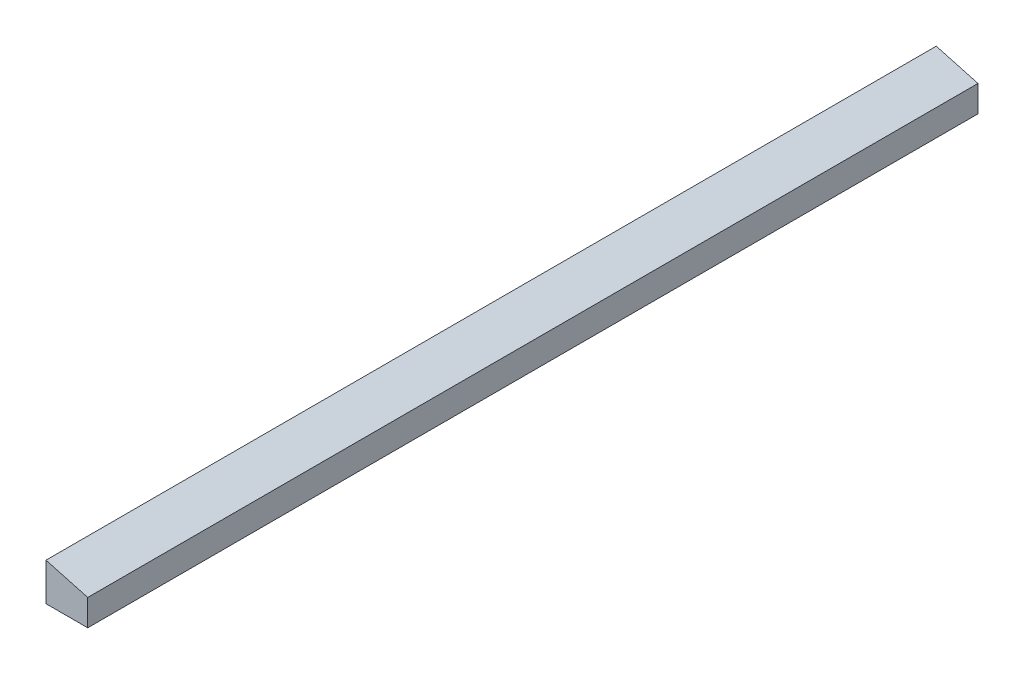
ISO-10303-21;
HEADER;
FILE_DESCRIPTION(('STEP AP214'),'2;1');
FILE_NAME('part.step','',(''),(''),'','','');
FILE_SCHEMA(('AUTOMOTIVE_DESIGN { 1 0 10303 214 1 1 1 1 }'));
ENDSEC;
DATA;
#1=APPLICATION_CONTEXT('core data for automotive mechanical design processes');
#2=APPLICATION_PROTOCOL_DEFINITION('international standard','automotive_design',2000,#1);
#3=PRODUCT_CONTEXT('',#1,'mechanical');
#4=PRODUCT('Part','Part','',(#3));
#5=PRODUCT_RELATED_PRODUCT_CATEGORY('part','',(#4));
#6=PRODUCT_DEFINITION_FORMATION('','',#4);
#7=PRODUCT_DEFINITION_CONTEXT('part definition',#1,'design');
#8=PRODUCT_DEFINITION('design','',#6,#7);
#9=PRODUCT_DEFINITION_SHAPE('','',#8);
#10=(LENGTH_UNIT() NAMED_UNIT(*) SI_UNIT(.MILLI.,.METRE.));
#11=(NAMED_UNIT(*) PLANE_ANGLE_UNIT() SI_UNIT($,.RADIAN.));
#12=(NAMED_UNIT(*) SI_UNIT($,.STERADIAN.) SOLID_ANGLE_UNIT());
#13=UNCERTAINTY_MEASURE_WITH_UNIT(LENGTH_MEASURE(1.E-05),#10,'distance_accuracy_value','');
#14=(GEOMETRIC_REPRESENTATION_CONTEXT(3) GLOBAL_UNCERTAINTY_ASSIGNED_CONTEXT((#13)) GLOBAL_UNIT_ASSIGNED_CONTEXT((#10,
#11,#12)) REPRESENTATION_CONTEXT('',''));
#15=CARTESIAN_POINT('',(0.,0.,0.));
#16=DIRECTION('',(0.,0.,1.));
#17=DIRECTION('',(1.,0.,0.));
#18=AXIS2_PLACEMENT_3D('',#15,#16,#17);
#19=CARTESIAN_POINT('',(28.575,0.,304.8));
#20=DIRECTION('',(1.,0.,0.));
#21=DIRECTION('',(0.,1.,0.));
#22=AXIS2_PLACEMENT_3D('',#19,#20,#21);
#23=PLANE('',#22);
#24=DIRECTION('',(0.,-1.,0.));
#25=VECTOR('',#24,1.);
#26=CARTESIAN_POINT('',(28.575,0.,-304.8));
#27=LINE('',#26,#25);
#28=CARTESIAN_POINT('',(28.575,24.3828853795112,-304.8));
#29=VERTEX_POINT('',#28);
#30=CARTESIAN_POINT('',(28.575,6.35,-304.8));
#31=VERTEX_POINT('',#30);
#32=EDGE_CURVE('E97',#29,#31,#27,.T.);
#33=ORIENTED_EDGE('',*,*,#32,.F.);
#34=DIRECTION('',(0.,0.,-1.));
#35=VECTOR('',#34,1.);
#36=CARTESIAN_POINT('',(28.575,24.3828853795112,304.8));
#37=LINE('',#36,#35);
#38=CARTESIAN_POINT('',(28.575,24.3828853795112,304.8));
#39=VERTEX_POINT('',#38);
#40=EDGE_CURVE('E11',#39,#29,#37,.T.);
#41=ORIENTED_EDGE('',*,*,#40,.F.);
#42=DIRECTION('',(0.,-1.,0.));
#43=VECTOR('',#42,1.);
#44=CARTESIAN_POINT('',(28.575,0.,304.8));
#45=LINE('',#44,#43);
#46=CARTESIAN_POINT('',(28.575,6.35,304.8));
#47=VERTEX_POINT('',#46);
#48=EDGE_CURVE('E90',#39,#47,#45,.T.);
#49=ORIENTED_EDGE('',*,*,#48,.T.);
#50=DIRECTION('',(0.,0.,-1.));
#51=VECTOR('',#50,1.);
#52=CARTESIAN_POINT('',(28.575,6.35,304.8));
#53=LINE('',#52,#51);
#54=EDGE_CURVE('E72',#47,#31,#53,.T.);
#55=ORIENTED_EDGE('',*,*,#54,.T.);
#56=EDGE_LOOP('',(#33,#41,#49,#55));
#57=FACE_BOUND('',#56,.T.);
#58=ADVANCED_FACE('F34',(#57),#23,.T.);
#59=CARTESIAN_POINT('',(8.19559753601362,29.9580590101716,304.8));
#60=DIRECTION('',(0.263873049965366,0.9645574184578,0.));
#61=DIRECTION('',(-0.9645574184578,0.263873049965366,0.));
#62=AXIS2_PLACEMENT_3D('',#59,#60,#61);
#63=PLANE('',#62);
#64=DIRECTION('',(0.9645574184578,-0.263873049965366,0.));
#65=VECTOR('',#64,1.);
#66=CARTESIAN_POINT('',(8.19559753601362,29.9580590101716,-304.8));
#67=LINE('',#66,#65);
#68=CARTESIAN_POINT('',(0.,32.2001207855859,-304.8));
#69=VERTEX_POINT('',#68);
#70=EDGE_CURVE('E83',#69,#29,#67,.T.);
#71=ORIENTED_EDGE('',*,*,#70,.F.);
#72=DIRECTION('',(0.,0.,-1.));
#73=VECTOR('',#72,1.);
#74=CARTESIAN_POINT('',(0.,32.2001207855859,304.8));
#75=LINE('',#74,#73);
#76=CARTESIAN_POINT('',(0.,32.2001207855859,304.8));
#77=VERTEX_POINT('',#76);
#78=EDGE_CURVE('E42',#77,#69,#75,.T.);
#79=ORIENTED_EDGE('',*,*,#78,.F.);
#80=DIRECTION('',(0.9645574184578,-0.263873049965366,0.));
#81=VECTOR('',#80,1.);
#82=CARTESIAN_POINT('',(8.19559753601362,29.9580590101716,304.8));
#83=LINE('',#82,#81);
#84=EDGE_CURVE('E81',#77,#39,#83,.T.);
#85=ORIENTED_EDGE('',*,*,#84,.T.);
#86=ORIENTED_EDGE('',*,*,#40,.T.);
#87=EDGE_LOOP('',(#71,#79,#85,#86));
#88=FACE_BOUND('',#87,.T.);
#89=ADVANCED_FACE('F80',(#88),#63,.T.);
#90=CARTESIAN_POINT('',(0.,0.,304.8));
#91=DIRECTION('',(-1.,0.,0.));
#92=DIRECTION('',(0.,-1.,0.));
#93=AXIS2_PLACEMENT_3D('',#90,#91,#92);
#94=PLANE('',#93);
#95=DIRECTION('',(0.,1.,0.));
#96=VECTOR('',#95,1.);
#97=CARTESIAN_POINT('',(0.,0.,-304.8));
#98=LINE('',#97,#96);
#99=CARTESIAN_POINT('',(0.,6.35,-304.8));
#100=VERTEX_POINT('',#99);
#101=EDGE_CURVE('E101',#100,#69,#98,.T.);
#102=ORIENTED_EDGE('',*,*,#101,.F.);
#103=DIRECTION('',(0.,0.,-1.));
#104=VECTOR('',#103,1.);
#105=CARTESIAN_POINT('',(0.,6.35,304.8));
#106=LINE('',#105,#104);
#107=CARTESIAN_POINT('',(0.,6.35,304.8));
#108=VERTEX_POINT('',#107);
#109=EDGE_CURVE('E65',#108,#100,#106,.T.);
#110=ORIENTED_EDGE('',*,*,#109,.F.);
#111=DIRECTION('',(0.,1.,0.));
#112=VECTOR('',#111,1.);
#113=CARTESIAN_POINT('',(0.,0.,304.8));
#114=LINE('',#113,#112);
#115=EDGE_CURVE('E89',#108,#77,#114,.T.);
#116=ORIENTED_EDGE('',*,*,#115,.T.);
#117=ORIENTED_EDGE('',*,*,#78,.T.);
#118=EDGE_LOOP('',(#102,#110,#116,#117));
#119=FACE_BOUND('',#118,.T.);
#120=ADVANCED_FACE('F92',(#119),#94,.T.);
#121=CARTESIAN_POINT('',(0.,6.35,304.8));
#122=DIRECTION('',(0.,1.,0.));
#123=DIRECTION('',(0.,0.,1.));
#124=AXIS2_PLACEMENT_3D('',#121,#122,#123);
#125=PLANE('',#124);
#126=DIRECTION('',(1.,0.,0.));
#127=VECTOR('',#126,1.);
#128=CARTESIAN_POINT('',(0.,6.35,-304.8));
#129=LINE('',#128,#127);
#130=EDGE_CURVE('E103',#100,#31,#129,.T.);
#131=ORIENTED_EDGE('',*,*,#130,.T.);
#132=ORIENTED_EDGE('',*,*,#54,.F.);
#133=DIRECTION('',(1.,0.,0.));
#134=VECTOR('',#133,1.);
#135=CARTESIAN_POINT('',(0.,6.35,304.8));
#136=LINE('',#135,#134);
#137=EDGE_CURVE('E50',#108,#47,#136,.T.);
#138=ORIENTED_EDGE('',*,*,#137,.F.);
#139=ORIENTED_EDGE('',*,*,#109,.T.);
#140=EDGE_LOOP('',(#131,#132,#138,#139));
#141=FACE_BOUND('',#140,.T.);
#142=ADVANCED_FACE('F113',(#141),#125,.F.);
#143=CARTESIAN_POINT('',(0.,0.,304.8));
#144=DIRECTION('',(0.,0.,1.));
#145=DIRECTION('',(1.,0.,0.));
#146=AXIS2_PLACEMENT_3D('',#143,#144,#145);
#147=PLANE('',#146);
#148=ORIENTED_EDGE('',*,*,#48,.F.);
#149=ORIENTED_EDGE('',*,*,#84,.F.);
#150=ORIENTED_EDGE('',*,*,#115,.F.);
#151=ORIENTED_EDGE('',*,*,#137,.T.);
#152=EDGE_LOOP('',(#148,#149,#150,#151));
#153=FACE_BOUND('',#152,.T.);
#154=ADVANCED_FACE('F88',(#153),#147,.T.);
#155=CARTESIAN_POINT('',(0.,0.,-304.8));
#156=DIRECTION('',(0.,0.,1.));
#157=DIRECTION('',(1.,0.,0.));
#158=AXIS2_PLACEMENT_3D('',#155,#156,#157);
#159=PLANE('',#158);
#160=ORIENTED_EDGE('',*,*,#32,.T.);
#161=ORIENTED_EDGE('',*,*,#130,.F.);
#162=ORIENTED_EDGE('',*,*,#101,.T.);
#163=ORIENTED_EDGE('',*,*,#70,.T.);
#164=EDGE_LOOP('',(#160,#161,#162,#163));
#165=FACE_BOUND('',#164,.T.);
#166=ADVANCED_FACE('F118',(#165),#159,.F.);
#167=CLOSED_SHELL('',(#58,#89,#120,#142,#154,#166));
#168=MANIFOLD_SOLID_BREP('B2',#167);
#169=ADVANCED_BREP_SHAPE_REPRESENTATION('',(#18,#168),#14);
#170=SHAPE_DEFINITION_REPRESENTATION(#9,#169);
ENDSEC;
END-ISO-10303-21;
